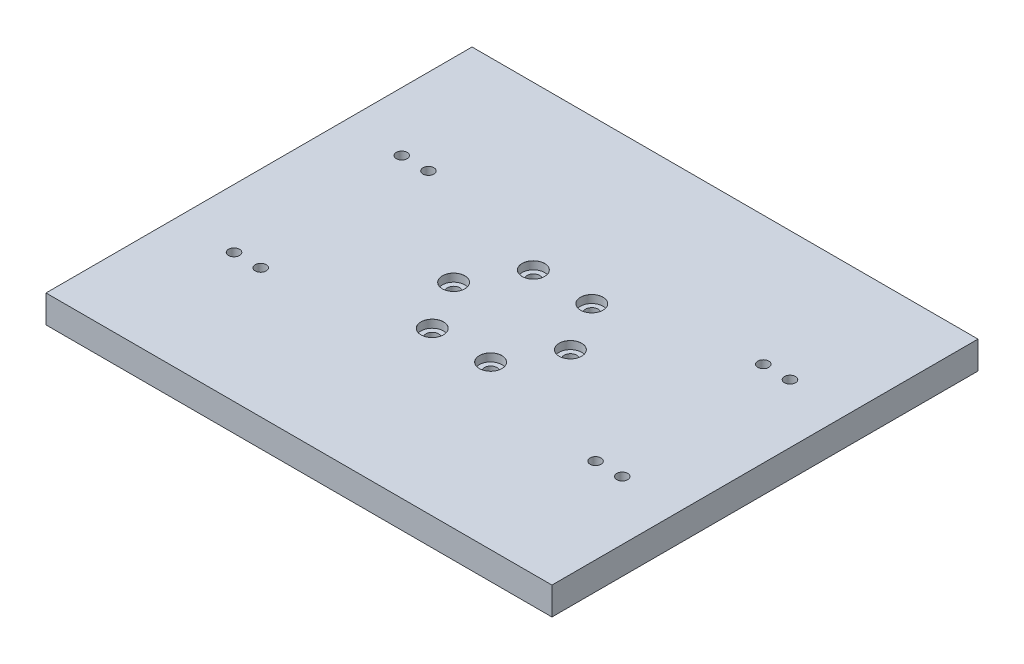
ISO-10303-21;
HEADER;
FILE_DESCRIPTION(('STEP AP214'),'2;1');
FILE_NAME('part.step','',(''),(''),'','','');
FILE_SCHEMA(('AUTOMOTIVE_DESIGN { 1 0 10303 214 1 1 1 1 }'));
ENDSEC;
DATA;
#1=APPLICATION_CONTEXT('core data for automotive mechanical design processes');
#2=APPLICATION_PROTOCOL_DEFINITION('international standard','automotive_design',2000,#1);
#3=PRODUCT_CONTEXT('',#1,'mechanical');
#4=PRODUCT('Part','Part','',(#3));
#5=PRODUCT_RELATED_PRODUCT_CATEGORY('part','',(#4));
#6=PRODUCT_DEFINITION_FORMATION('','',#4);
#7=PRODUCT_DEFINITION_CONTEXT('part definition',#1,'design');
#8=PRODUCT_DEFINITION('design','',#6,#7);
#9=PRODUCT_DEFINITION_SHAPE('','',#8);
#10=(LENGTH_UNIT() NAMED_UNIT(*) SI_UNIT(.MILLI.,.METRE.));
#11=(NAMED_UNIT(*) PLANE_ANGLE_UNIT() SI_UNIT($,.RADIAN.));
#12=(NAMED_UNIT(*) SI_UNIT($,.STERADIAN.) SOLID_ANGLE_UNIT());
#13=UNCERTAINTY_MEASURE_WITH_UNIT(LENGTH_MEASURE(1.E-05),#10,'distance_accuracy_value','');
#14=(GEOMETRIC_REPRESENTATION_CONTEXT(3) GLOBAL_UNCERTAINTY_ASSIGNED_CONTEXT((#13)) GLOBAL_UNIT_ASSIGNED_CONTEXT((#10,
#11,#12)) REPRESENTATION_CONTEXT('',''));
#15=CARTESIAN_POINT('',(0.,0.,0.));
#16=DIRECTION('',(0.,0.,1.));
#17=DIRECTION('',(1.,0.,0.));
#18=AXIS2_PLACEMENT_3D('',#15,#16,#17);
#19=CARTESIAN_POINT('',(241.3,26.416,203.2));
#20=DIRECTION('',(-1.,0.,0.));
#21=DIRECTION('',(0.,0.,1.));
#22=AXIS2_PLACEMENT_3D('',#19,#20,#21);
#23=PLANE('',#22);
#24=DIRECTION('',(0.,0.,-1.));
#25=VECTOR('',#24,1.);
#26=CARTESIAN_POINT('',(241.3,0.,203.2));
#27=LINE('',#26,#25);
#28=CARTESIAN_POINT('',(241.3,0.,203.2));
#29=VERTEX_POINT('',#28);
#30=CARTESIAN_POINT('',(241.3,0.,-203.2));
#31=VERTEX_POINT('',#30);
#32=EDGE_CURVE('E111',#29,#31,#27,.T.);
#33=ORIENTED_EDGE('',*,*,#32,.T.);
#34=DIRECTION('',(0.,-1.,0.));
#35=VECTOR('',#34,1.);
#36=CARTESIAN_POINT('',(241.3,26.416,-203.2));
#37=LINE('',#36,#35);
#38=CARTESIAN_POINT('',(241.3,26.416,-203.2));
#39=VERTEX_POINT('',#38);
#40=EDGE_CURVE('E11',#39,#31,#37,.T.);
#41=ORIENTED_EDGE('',*,*,#40,.F.);
#42=DIRECTION('',(0.,0.,-1.));
#43=VECTOR('',#42,1.);
#44=CARTESIAN_POINT('',(241.3,26.416,203.2));
#45=LINE('',#44,#43);
#46=CARTESIAN_POINT('',(241.3,26.416,203.2));
#47=VERTEX_POINT('',#46);
#48=EDGE_CURVE('E95',#47,#39,#45,.T.);
#49=ORIENTED_EDGE('',*,*,#48,.F.);
#50=DIRECTION('',(0.,-1.,0.));
#51=VECTOR('',#50,1.);
#52=CARTESIAN_POINT('',(241.3,26.416,203.2));
#53=LINE('',#52,#51);
#54=EDGE_CURVE('E107',#47,#29,#53,.T.);
#55=ORIENTED_EDGE('',*,*,#54,.T.);
#56=EDGE_LOOP('',(#33,#41,#49,#55));
#57=FACE_BOUND('',#56,.T.);
#58=ADVANCED_FACE('F43',(#57),#23,.F.);
#59=CARTESIAN_POINT('',(-241.3,26.416,-203.2));
#60=DIRECTION('',(0.,0.,1.));
#61=DIRECTION('',(1.,0.,0.));
#62=AXIS2_PLACEMENT_3D('',#59,#60,#61);
#63=PLANE('',#62);
#64=DIRECTION('',(-1.,0.,0.));
#65=VECTOR('',#64,1.);
#66=CARTESIAN_POINT('',(-241.3,0.,-203.2));
#67=LINE('',#66,#65);
#68=CARTESIAN_POINT('',(-241.3,0.,-203.2));
#69=VERTEX_POINT('',#68);
#70=EDGE_CURVE('E100',#31,#69,#67,.T.);
#71=ORIENTED_EDGE('',*,*,#70,.T.);
#72=DIRECTION('',(0.,-1.,0.));
#73=VECTOR('',#72,1.);
#74=CARTESIAN_POINT('',(-241.3,26.416,-203.2));
#75=LINE('',#74,#73);
#76=CARTESIAN_POINT('',(-241.3,26.416,-203.2));
#77=VERTEX_POINT('',#76);
#78=EDGE_CURVE('E52',#77,#69,#75,.T.);
#79=ORIENTED_EDGE('',*,*,#78,.F.);
#80=DIRECTION('',(-1.,0.,0.));
#81=VECTOR('',#80,1.);
#82=CARTESIAN_POINT('',(-241.3,26.416,-203.2));
#83=LINE('',#82,#81);
#84=EDGE_CURVE('E90',#39,#77,#83,.T.);
#85=ORIENTED_EDGE('',*,*,#84,.F.);
#86=ORIENTED_EDGE('',*,*,#40,.T.);
#87=EDGE_LOOP('',(#71,#79,#85,#86));
#88=FACE_BOUND('',#87,.T.);
#89=ADVANCED_FACE('F99',(#88),#63,.F.);
#90=CARTESIAN_POINT('',(-241.3,26.416,203.2));
#91=DIRECTION('',(1.,0.,0.));
#92=DIRECTION('',(0.,0.,-1.));
#93=AXIS2_PLACEMENT_3D('',#90,#91,#92);
#94=PLANE('',#93);
#95=DIRECTION('',(0.,0.,1.));
#96=VECTOR('',#95,1.);
#97=CARTESIAN_POINT('',(-241.3,0.,203.2));
#98=LINE('',#97,#96);
#99=CARTESIAN_POINT('',(-241.3,0.,203.2));
#100=VERTEX_POINT('',#99);
#101=EDGE_CURVE('E77',#69,#100,#98,.T.);
#102=ORIENTED_EDGE('',*,*,#101,.T.);
#103=DIRECTION('',(0.,-1.,0.));
#104=VECTOR('',#103,1.);
#105=CARTESIAN_POINT('',(-241.3,26.416,203.2));
#106=LINE('',#105,#104);
#107=CARTESIAN_POINT('',(-241.3,26.416,203.2));
#108=VERTEX_POINT('',#107);
#109=EDGE_CURVE('E102',#108,#100,#106,.T.);
#110=ORIENTED_EDGE('',*,*,#109,.F.);
#111=DIRECTION('',(0.,0.,1.));
#112=VECTOR('',#111,1.);
#113=CARTESIAN_POINT('',(-241.3,26.416,203.2));
#114=LINE('',#113,#112);
#115=EDGE_CURVE('E93',#77,#108,#114,.T.);
#116=ORIENTED_EDGE('',*,*,#115,.F.);
#117=ORIENTED_EDGE('',*,*,#78,.T.);
#118=EDGE_LOOP('',(#102,#110,#116,#117));
#119=FACE_BOUND('',#118,.T.);
#120=ADVANCED_FACE('F103',(#119),#94,.F.);
#121=CARTESIAN_POINT('',(-241.3,26.416,203.2));
#122=DIRECTION('',(0.,0.,-1.));
#123=DIRECTION('',(-1.,0.,0.));
#124=AXIS2_PLACEMENT_3D('',#121,#122,#123);
#125=PLANE('',#124);
#126=DIRECTION('',(1.,0.,0.));
#127=VECTOR('',#126,1.);
#128=CARTESIAN_POINT('',(-241.3,0.,203.2));
#129=LINE('',#128,#127);
#130=EDGE_CURVE('E83',#100,#29,#129,.T.);
#131=ORIENTED_EDGE('',*,*,#130,.T.);
#132=ORIENTED_EDGE('',*,*,#54,.F.);
#133=DIRECTION('',(1.,0.,0.));
#134=VECTOR('',#133,1.);
#135=CARTESIAN_POINT('',(-241.3,26.416,203.2));
#136=LINE('',#135,#134);
#137=EDGE_CURVE('E60',#108,#47,#136,.T.);
#138=ORIENTED_EDGE('',*,*,#137,.F.);
#139=ORIENTED_EDGE('',*,*,#109,.T.);
#140=EDGE_LOOP('',(#131,#132,#138,#139));
#141=FACE_BOUND('',#140,.T.);
#142=ADVANCED_FACE('F125',(#141),#125,.F.);
#143=CARTESIAN_POINT('',(0.,26.416,0.));
#144=DIRECTION('',(0.,-1.,0.));
#145=DIRECTION('',(0.,0.,-1.));
#146=AXIS2_PLACEMENT_3D('',#143,#144,#145);
#147=PLANE('',#146);
#148=CARTESIAN_POINT('',(-185.152559706437,26.416,80.01));
#149=DIRECTION('',(0.,1.,0.));
#150=DIRECTION('',(0.,0.,1.));
#151=AXIS2_PLACEMENT_3D('',#148,#149,#150);
#152=CIRCLE('',#151,5.25);
#153=CARTESIAN_POINT('',(-185.152559706437,26.416,85.26));
#154=VERTEX_POINT('',#153);
#155=EDGE_CURVE('E311',#154,#154,#152,.T.);
#156=ORIENTED_EDGE('',*,*,#155,.F.);
#157=EDGE_LOOP('',(#156));
#158=FACE_BOUND('',#157,.T.);
#159=CARTESIAN_POINT('',(-159.68726,26.416,80.01));
#160=DIRECTION('',(0.,1.,0.));
#161=DIRECTION('',(0.,0.,1.));
#162=AXIS2_PLACEMENT_3D('',#159,#160,#161);
#163=CIRCLE('',#162,5.25);
#164=CARTESIAN_POINT('',(-159.68726,26.416,85.26));
#165=VERTEX_POINT('',#164);
#166=EDGE_CURVE('E303',#165,#165,#163,.T.);
#167=ORIENTED_EDGE('',*,*,#166,.F.);
#168=EDGE_LOOP('',(#167));
#169=FACE_BOUND('',#168,.T.);
#170=CARTESIAN_POINT('',(-185.152559706437,26.416,-80.01));
#171=DIRECTION('',(0.,1.,0.));
#172=DIRECTION('',(0.,0.,1.));
#173=AXIS2_PLACEMENT_3D('',#170,#171,#172);
#174=CIRCLE('',#173,5.25);
#175=CARTESIAN_POINT('',(-185.152559706437,26.416,-74.76));
#176=VERTEX_POINT('',#175);
#177=EDGE_CURVE('E295',#176,#176,#174,.T.);
#178=ORIENTED_EDGE('',*,*,#177,.F.);
#179=EDGE_LOOP('',(#178));
#180=FACE_BOUND('',#179,.T.);
#181=CARTESIAN_POINT('',(-159.68726,26.416,-80.01));
#182=DIRECTION('',(0.,1.,0.));
#183=DIRECTION('',(0.,0.,1.));
#184=AXIS2_PLACEMENT_3D('',#181,#182,#183);
#185=CIRCLE('',#184,5.25);
#186=CARTESIAN_POINT('',(-159.68726,26.416,-74.76));
#187=VERTEX_POINT('',#186);
#188=EDGE_CURVE('E287',#187,#187,#185,.T.);
#189=ORIENTED_EDGE('',*,*,#188,.F.);
#190=EDGE_LOOP('',(#189));
#191=FACE_BOUND('',#190,.T.);
#192=CARTESIAN_POINT('',(185.152559706437,26.416,-80.01));
#193=DIRECTION('',(0.,1.,0.));
#194=DIRECTION('',(0.,0.,1.));
#195=AXIS2_PLACEMENT_3D('',#192,#193,#194);
#196=CIRCLE('',#195,5.25);
#197=CARTESIAN_POINT('',(185.152559706437,26.416,-74.76));
#198=VERTEX_POINT('',#197);
#199=EDGE_CURVE('E279',#198,#198,#196,.T.);
#200=ORIENTED_EDGE('',*,*,#199,.F.);
#201=EDGE_LOOP('',(#200));
#202=FACE_BOUND('',#201,.T.);
#203=CARTESIAN_POINT('',(159.68726,26.416,-80.01));
#204=DIRECTION('',(0.,1.,0.));
#205=DIRECTION('',(0.,0.,1.));
#206=AXIS2_PLACEMENT_3D('',#203,#204,#205);
#207=CIRCLE('',#206,5.25);
#208=CARTESIAN_POINT('',(159.68726,26.416,-74.76));
#209=VERTEX_POINT('',#208);
#210=EDGE_CURVE('E271',#209,#209,#207,.T.);
#211=ORIENTED_EDGE('',*,*,#210,.F.);
#212=EDGE_LOOP('',(#211));
#213=FACE_BOUND('',#212,.T.);
#214=CARTESIAN_POINT('',(185.152559706437,26.416,80.01));
#215=DIRECTION('',(0.,1.,0.));
#216=DIRECTION('',(0.,0.,1.));
#217=AXIS2_PLACEMENT_3D('',#214,#215,#216);
#218=CIRCLE('',#217,5.25);
#219=CARTESIAN_POINT('',(185.152559706437,26.416,85.26));
#220=VERTEX_POINT('',#219);
#221=EDGE_CURVE('E263',#220,#220,#218,.T.);
#222=ORIENTED_EDGE('',*,*,#221,.F.);
#223=EDGE_LOOP('',(#222));
#224=FACE_BOUND('',#223,.T.);
#225=CARTESIAN_POINT('',(159.68726,26.416,80.01));
#226=DIRECTION('',(0.,1.,0.));
#227=DIRECTION('',(0.,0.,1.));
#228=AXIS2_PLACEMENT_3D('',#225,#226,#227);
#229=CIRCLE('',#228,5.25);
#230=CARTESIAN_POINT('',(159.68726,26.416,85.26));
#231=VERTEX_POINT('',#230);
#232=EDGE_CURVE('E255',#231,#231,#229,.T.);
#233=ORIENTED_EDGE('',*,*,#232,.F.);
#234=EDGE_LOOP('',(#233));
#235=FACE_BOUND('',#234,.T.);
#236=CARTESIAN_POINT('',(27.8500000000006,26.416,-48.2376149907929));
#237=DIRECTION('',(0.,1.,0.));
#238=DIRECTION('',(0.,0.,1.));
#239=AXIS2_PLACEMENT_3D('',#236,#237,#238);
#240=CIRCLE('',#239,10.765);
#241=CARTESIAN_POINT('',(27.8500000000006,26.416,-37.4726149907929));
#242=VERTEX_POINT('',#241);
#243=EDGE_CURVE('E247',#242,#242,#240,.T.);
#244=ORIENTED_EDGE('',*,*,#243,.F.);
#245=EDGE_LOOP('',(#244));
#246=FACE_BOUND('',#245,.T.);
#247=CARTESIAN_POINT('',(55.7,26.416,0.));
#248=DIRECTION('',(0.,1.,0.));
#249=DIRECTION('',(0.,0.,1.));
#250=AXIS2_PLACEMENT_3D('',#247,#248,#249);
#251=CIRCLE('',#250,10.765);
#252=CARTESIAN_POINT('',(55.7,26.416,10.765));
#253=VERTEX_POINT('',#252);
#254=EDGE_CURVE('E227',#253,#253,#251,.T.);
#255=ORIENTED_EDGE('',*,*,#254,.F.);
#256=EDGE_LOOP('',(#255));
#257=FACE_BOUND('',#256,.T.);
#258=CARTESIAN_POINT('',(27.8499999999999,26.416,48.2376149907933));
#259=DIRECTION('',(0.,1.,0.));
#260=DIRECTION('',(0.,0.,1.));
#261=AXIS2_PLACEMENT_3D('',#258,#259,#260);
#262=CIRCLE('',#261,10.765);
#263=CARTESIAN_POINT('',(27.8499999999999,26.416,59.0026149907933));
#264=VERTEX_POINT('',#263);
#265=EDGE_CURVE('E207',#264,#264,#262,.T.);
#266=ORIENTED_EDGE('',*,*,#265,.F.);
#267=EDGE_LOOP('',(#266));
#268=FACE_BOUND('',#267,.T.);
#269=CARTESIAN_POINT('',(-27.8500000000002,26.416,48.2376149907931));
#270=DIRECTION('',(0.,1.,0.));
#271=DIRECTION('',(0.,0.,1.));
#272=AXIS2_PLACEMENT_3D('',#269,#270,#271);
#273=CIRCLE('',#272,10.765);
#274=CARTESIAN_POINT('',(-27.8500000000002,26.416,59.0026149907931));
#275=VERTEX_POINT('',#274);
#276=EDGE_CURVE('E187',#275,#275,#273,.T.);
#277=ORIENTED_EDGE('',*,*,#276,.F.);
#278=EDGE_LOOP('',(#277));
#279=FACE_BOUND('',#278,.T.);
#280=CARTESIAN_POINT('',(-55.7,26.416,-3.88951021147125E-13));
#281=DIRECTION('',(0.,1.,0.));
#282=DIRECTION('',(0.,0.,1.));
#283=AXIS2_PLACEMENT_3D('',#280,#281,#282);
#284=CIRCLE('',#283,10.765);
#285=CARTESIAN_POINT('',(-55.7,26.416,10.7649999999996));
#286=VERTEX_POINT('',#285);
#287=EDGE_CURVE('E167',#286,#286,#284,.T.);
#288=ORIENTED_EDGE('',*,*,#287,.F.);
#289=EDGE_LOOP('',(#288));
#290=FACE_BOUND('',#289,.T.);
#291=CARTESIAN_POINT('',(-27.8500000000002,26.416,-48.2376149907929));
#292=DIRECTION('',(0.,1.,0.));
#293=DIRECTION('',(0.,0.,1.));
#294=AXIS2_PLACEMENT_3D('',#291,#292,#293);
#295=CIRCLE('',#294,10.765);
#296=CARTESIAN_POINT('',(-27.8500000000002,26.416,-37.4726149907929));
#297=VERTEX_POINT('',#296);
#298=EDGE_CURVE('E147',#297,#297,#295,.T.);
#299=ORIENTED_EDGE('',*,*,#298,.F.);
#300=EDGE_LOOP('',(#299));
#301=FACE_BOUND('',#300,.T.);
#302=ORIENTED_EDGE('',*,*,#48,.T.);
#303=ORIENTED_EDGE('',*,*,#84,.T.);
#304=ORIENTED_EDGE('',*,*,#115,.T.);
#305=ORIENTED_EDGE('',*,*,#137,.T.);
#306=EDGE_LOOP('',(#302,#303,#304,#305));
#307=FACE_BOUND('',#306,.T.);
#308=ADVANCED_FACE('F91',(#158,#169,#180,#191,#202,#213,#224,#235,#246,#257,#268,#279,#290,#301,
#307),#147,.F.);
#309=CARTESIAN_POINT('',(0.,0.,0.));
#310=DIRECTION('',(0.,-1.,0.));
#311=DIRECTION('',(0.,0.,-1.));
#312=AXIS2_PLACEMENT_3D('',#309,#310,#311);
#313=PLANE('',#312);
#314=CARTESIAN_POINT('',(-185.152559706437,0.,80.01));
#315=DIRECTION('',(0.,1.,0.));
#316=DIRECTION('',(0.,0.,1.));
#317=AXIS2_PLACEMENT_3D('',#314,#315,#316);
#318=CIRCLE('',#317,5.25);
#319=CARTESIAN_POINT('',(-185.152559706437,0.,85.26));
#320=VERTEX_POINT('',#319);
#321=EDGE_CURVE('E307',#320,#320,#318,.T.);
#322=ORIENTED_EDGE('',*,*,#321,.T.);
#323=EDGE_LOOP('',(#322));
#324=FACE_BOUND('',#323,.T.);
#325=CARTESIAN_POINT('',(-159.68726,0.,80.01));
#326=DIRECTION('',(0.,1.,0.));
#327=DIRECTION('',(0.,0.,1.));
#328=AXIS2_PLACEMENT_3D('',#325,#326,#327);
#329=CIRCLE('',#328,5.25);
#330=CARTESIAN_POINT('',(-159.68726,0.,85.26));
#331=VERTEX_POINT('',#330);
#332=EDGE_CURVE('E299',#331,#331,#329,.T.);
#333=ORIENTED_EDGE('',*,*,#332,.T.);
#334=EDGE_LOOP('',(#333));
#335=FACE_BOUND('',#334,.T.);
#336=CARTESIAN_POINT('',(-185.152559706437,0.,-80.01));
#337=DIRECTION('',(0.,1.,0.));
#338=DIRECTION('',(0.,0.,1.));
#339=AXIS2_PLACEMENT_3D('',#336,#337,#338);
#340=CIRCLE('',#339,5.25);
#341=CARTESIAN_POINT('',(-185.152559706437,0.,-74.76));
#342=VERTEX_POINT('',#341);
#343=EDGE_CURVE('E291',#342,#342,#340,.T.);
#344=ORIENTED_EDGE('',*,*,#343,.T.);
#345=EDGE_LOOP('',(#344));
#346=FACE_BOUND('',#345,.T.);
#347=CARTESIAN_POINT('',(-159.68726,0.,-80.01));
#348=DIRECTION('',(0.,1.,0.));
#349=DIRECTION('',(0.,0.,1.));
#350=AXIS2_PLACEMENT_3D('',#347,#348,#349);
#351=CIRCLE('',#350,5.25);
#352=CARTESIAN_POINT('',(-159.68726,0.,-74.76));
#353=VERTEX_POINT('',#352);
#354=EDGE_CURVE('E283',#353,#353,#351,.T.);
#355=ORIENTED_EDGE('',*,*,#354,.T.);
#356=EDGE_LOOP('',(#355));
#357=FACE_BOUND('',#356,.T.);
#358=CARTESIAN_POINT('',(185.152559706437,0.,-80.01));
#359=DIRECTION('',(0.,1.,0.));
#360=DIRECTION('',(0.,0.,1.));
#361=AXIS2_PLACEMENT_3D('',#358,#359,#360);
#362=CIRCLE('',#361,5.25);
#363=CARTESIAN_POINT('',(185.152559706437,0.,-74.76));
#364=VERTEX_POINT('',#363);
#365=EDGE_CURVE('E275',#364,#364,#362,.T.);
#366=ORIENTED_EDGE('',*,*,#365,.T.);
#367=EDGE_LOOP('',(#366));
#368=FACE_BOUND('',#367,.T.);
#369=CARTESIAN_POINT('',(159.68726,0.,-80.01));
#370=DIRECTION('',(0.,1.,0.));
#371=DIRECTION('',(0.,0.,1.));
#372=AXIS2_PLACEMENT_3D('',#369,#370,#371);
#373=CIRCLE('',#372,5.25);
#374=CARTESIAN_POINT('',(159.68726,0.,-74.76));
#375=VERTEX_POINT('',#374);
#376=EDGE_CURVE('E267',#375,#375,#373,.T.);
#377=ORIENTED_EDGE('',*,*,#376,.T.);
#378=EDGE_LOOP('',(#377));
#379=FACE_BOUND('',#378,.T.);
#380=CARTESIAN_POINT('',(185.152559706437,0.,80.01));
#381=DIRECTION('',(0.,1.,0.));
#382=DIRECTION('',(0.,0.,1.));
#383=AXIS2_PLACEMENT_3D('',#380,#381,#382);
#384=CIRCLE('',#383,5.25);
#385=CARTESIAN_POINT('',(185.152559706437,0.,85.26));
#386=VERTEX_POINT('',#385);
#387=EDGE_CURVE('E259',#386,#386,#384,.T.);
#388=ORIENTED_EDGE('',*,*,#387,.T.);
#389=EDGE_LOOP('',(#388));
#390=FACE_BOUND('',#389,.T.);
#391=CARTESIAN_POINT('',(159.68726,0.,80.01));
#392=DIRECTION('',(0.,1.,0.));
#393=DIRECTION('',(0.,0.,1.));
#394=AXIS2_PLACEMENT_3D('',#391,#392,#393);
#395=CIRCLE('',#394,5.25);
#396=CARTESIAN_POINT('',(159.68726,0.,85.26));
#397=VERTEX_POINT('',#396);
#398=EDGE_CURVE('E251',#397,#397,#395,.T.);
#399=ORIENTED_EDGE('',*,*,#398,.T.);
#400=EDGE_LOOP('',(#399));
#401=FACE_BOUND('',#400,.T.);
#402=CARTESIAN_POINT('',(27.8500000000006,0.,-48.2376149907929));
#403=DIRECTION('',(0.,1.,0.));
#404=DIRECTION('',(0.,0.,1.));
#405=AXIS2_PLACEMENT_3D('',#402,#403,#404);
#406=CIRCLE('',#405,5.99999999999999);
#407=CARTESIAN_POINT('',(27.8500000000006,0.,-42.2376149907929));
#408=VERTEX_POINT('',#407);
#409=EDGE_CURVE('E231',#408,#408,#406,.T.);
#410=ORIENTED_EDGE('',*,*,#409,.T.);
#411=EDGE_LOOP('',(#410));
#412=FACE_BOUND('',#411,.T.);
#413=CARTESIAN_POINT('',(55.7,0.,0.));
#414=DIRECTION('',(0.,1.,0.));
#415=DIRECTION('',(0.,0.,1.));
#416=AXIS2_PLACEMENT_3D('',#413,#414,#415);
#417=CIRCLE('',#416,5.99999999999999);
#418=CARTESIAN_POINT('',(55.7,0.,5.99999999999999));
#419=VERTEX_POINT('',#418);
#420=EDGE_CURVE('E211',#419,#419,#417,.T.);
#421=ORIENTED_EDGE('',*,*,#420,.T.);
#422=EDGE_LOOP('',(#421));
#423=FACE_BOUND('',#422,.T.);
#424=CARTESIAN_POINT('',(27.8499999999999,0.,48.2376149907933));
#425=DIRECTION('',(0.,1.,0.));
#426=DIRECTION('',(0.,0.,1.));
#427=AXIS2_PLACEMENT_3D('',#424,#425,#426);
#428=CIRCLE('',#427,5.99999999999999);
#429=CARTESIAN_POINT('',(27.8499999999999,0.,54.2376149907933));
#430=VERTEX_POINT('',#429);
#431=EDGE_CURVE('E191',#430,#430,#428,.T.);
#432=ORIENTED_EDGE('',*,*,#431,.T.);
#433=EDGE_LOOP('',(#432));
#434=FACE_BOUND('',#433,.T.);
#435=CARTESIAN_POINT('',(-27.8500000000002,0.,48.2376149907931));
#436=DIRECTION('',(0.,1.,0.));
#437=DIRECTION('',(0.,0.,1.));
#438=AXIS2_PLACEMENT_3D('',#435,#436,#437);
#439=CIRCLE('',#438,5.99999999999999);
#440=CARTESIAN_POINT('',(-27.8500000000002,0.,54.2376149907931));
#441=VERTEX_POINT('',#440);
#442=EDGE_CURVE('E171',#441,#441,#439,.T.);
#443=ORIENTED_EDGE('',*,*,#442,.T.);
#444=EDGE_LOOP('',(#443));
#445=FACE_BOUND('',#444,.T.);
#446=CARTESIAN_POINT('',(-55.7,0.,-3.88951021147125E-13));
#447=DIRECTION('',(0.,1.,0.));
#448=DIRECTION('',(0.,0.,1.));
#449=AXIS2_PLACEMENT_3D('',#446,#447,#448);
#450=CIRCLE('',#449,5.99999999999999);
#451=CARTESIAN_POINT('',(-55.7,0.,5.9999999999996));
#452=VERTEX_POINT('',#451);
#453=EDGE_CURVE('E151',#452,#452,#450,.T.);
#454=ORIENTED_EDGE('',*,*,#453,.T.);
#455=EDGE_LOOP('',(#454));
#456=FACE_BOUND('',#455,.T.);
#457=CARTESIAN_POINT('',(-27.8500000000002,0.,-48.2376149907929));
#458=DIRECTION('',(0.,1.,0.));
#459=DIRECTION('',(0.,0.,1.));
#460=AXIS2_PLACEMENT_3D('',#457,#458,#459);
#461=CIRCLE('',#460,5.99999999999999);
#462=CARTESIAN_POINT('',(-27.8500000000002,0.,-42.2376149907929));
#463=VERTEX_POINT('',#462);
#464=EDGE_CURVE('E115',#463,#463,#461,.T.);
#465=ORIENTED_EDGE('',*,*,#464,.T.);
#466=EDGE_LOOP('',(#465));
#467=FACE_BOUND('',#466,.T.);
#468=ORIENTED_EDGE('',*,*,#32,.F.);
#469=ORIENTED_EDGE('',*,*,#130,.F.);
#470=ORIENTED_EDGE('',*,*,#101,.F.);
#471=ORIENTED_EDGE('',*,*,#70,.F.);
#472=EDGE_LOOP('',(#468,#469,#470,#471));
#473=FACE_BOUND('',#472,.T.);
#474=ADVANCED_FACE('F128',(#324,#335,#346,#357,#368,#379,#390,#401,#412,#423,#434,#445,#456,
#467,#473),#313,.T.);
#475=CARTESIAN_POINT('',(-27.8500000000002,26.416,-48.2376149907929));
#476=DIRECTION('',(0.,1.,0.));
#477=DIRECTION('',(0.,0.,1.));
#478=AXIS2_PLACEMENT_3D('',#475,#476,#477);
#479=CYLINDRICAL_SURFACE('',#478,6.);
#480=ORIENTED_EDGE('',*,*,#464,.F.);
#481=EDGE_LOOP('',(#480));
#482=FACE_BOUND('',#481,.T.);
#483=CARTESIAN_POINT('',(-27.8500000000002,18.916,-48.2376149907929));
#484=DIRECTION('',(0.,1.,0.));
#485=DIRECTION('',(0.,0.,1.));
#486=AXIS2_PLACEMENT_3D('',#483,#484,#485);
#487=CIRCLE('',#486,6.);
#488=CARTESIAN_POINT('',(-27.8500000000002,18.916,-42.2376149907929));
#489=VERTEX_POINT('',#488);
#490=EDGE_CURVE('E135',#489,#489,#487,.T.);
#491=ORIENTED_EDGE('',*,*,#490,.T.);
#492=EDGE_LOOP('',(#491));
#493=FACE_BOUND('',#492,.T.);
#494=ADVANCED_FACE('F376',(#482,#493),#479,.F.);
#495=CARTESIAN_POINT('',(-17.1100000000002,18.916,-48.2376149907929));
#496=DIRECTION('',(0.,-1.,0.));
#497=DIRECTION('',(0.,0.,-1.));
#498=AXIS2_PLACEMENT_3D('',#495,#496,#497);
#499=PLANE('',#498);
#500=ORIENTED_EDGE('',*,*,#490,.F.);
#501=EDGE_LOOP('',(#500));
#502=FACE_BOUND('',#501,.T.);
#503=CARTESIAN_POINT('',(-27.8500000000002,18.916,-48.2376149907929));
#504=DIRECTION('',(0.,1.,0.));
#505=DIRECTION('',(0.,0.,1.));
#506=AXIS2_PLACEMENT_3D('',#503,#504,#505);
#507=CIRCLE('',#506,10.74);
#508=CARTESIAN_POINT('',(-27.8500000000002,18.916,-37.4976149907929));
#509=VERTEX_POINT('',#508);
#510=EDGE_CURVE('E139',#509,#509,#507,.T.);
#511=ORIENTED_EDGE('',*,*,#510,.T.);
#512=EDGE_LOOP('',(#511));
#513=FACE_BOUND('',#512,.T.);
#514=ADVANCED_FACE('F360',(#502,#513),#499,.F.);
#515=CARTESIAN_POINT('',(-27.8500000000002,26.416,-48.2376149907929));
#516=DIRECTION('',(0.,1.,0.));
#517=DIRECTION('',(0.,0.,1.));
#518=AXIS2_PLACEMENT_3D('',#515,#516,#517);
#519=CYLINDRICAL_SURFACE('',#518,10.74);
#520=ORIENTED_EDGE('',*,*,#510,.F.);
#521=EDGE_LOOP('',(#520));
#522=FACE_BOUND('',#521,.T.);
#523=CARTESIAN_POINT('',(-27.8500000000002,26.391,-48.2376149907929));
#524=DIRECTION('',(0.,1.,0.));
#525=DIRECTION('',(0.,0.,1.));
#526=AXIS2_PLACEMENT_3D('',#523,#524,#525);
#527=CIRCLE('',#526,10.74);
#528=CARTESIAN_POINT('',(-27.8500000000002,26.391,-37.4976149907929));
#529=VERTEX_POINT('',#528);
#530=EDGE_CURVE('E143',#529,#529,#527,.T.);
#531=ORIENTED_EDGE('',*,*,#530,.T.);
#532=EDGE_LOOP('',(#531));
#533=FACE_BOUND('',#532,.T.);
#534=ADVANCED_FACE('F350',(#522,#533),#519,.F.);
#535=CARTESIAN_POINT('',(-27.8500000000002,26.416,-48.2376149907929));
#536=DIRECTION('',(0.,1.,0.));
#537=DIRECTION('',(0.,0.,1.));
#538=AXIS2_PLACEMENT_3D('',#535,#536,#537);
#539=CONICAL_SURFACE('',#538,10.765,0.785398163397379);
#540=ORIENTED_EDGE('',*,*,#530,.F.);
#541=EDGE_LOOP('',(#540));
#542=FACE_BOUND('',#541,.T.);
#543=ORIENTED_EDGE('',*,*,#298,.T.);
#544=EDGE_LOOP('',(#543));
#545=FACE_BOUND('',#544,.T.);
#546=ADVANCED_FACE('F347',(#542,#545),#539,.F.);
#547=CARTESIAN_POINT('',(-55.7,26.416,-3.88951021147125E-13));
#548=DIRECTION('',(0.,1.,0.));
#549=DIRECTION('',(0.,0.,1.));
#550=AXIS2_PLACEMENT_3D('',#547,#548,#549);
#551=CYLINDRICAL_SURFACE('',#550,5.99999999999999);
#552=ORIENTED_EDGE('',*,*,#453,.F.);
#553=EDGE_LOOP('',(#552));
#554=FACE_BOUND('',#553,.T.);
#555=CARTESIAN_POINT('',(-55.7,18.916,-3.88951021147125E-13));
#556=DIRECTION('',(0.,1.,0.));
#557=DIRECTION('',(0.,0.,1.));
#558=AXIS2_PLACEMENT_3D('',#555,#556,#557);
#559=CIRCLE('',#558,6.);
#560=CARTESIAN_POINT('',(-55.7,18.916,5.99999999999961));
#561=VERTEX_POINT('',#560);
#562=EDGE_CURVE('E155',#561,#561,#559,.T.);
#563=ORIENTED_EDGE('',*,*,#562,.T.);
#564=EDGE_LOOP('',(#563));
#565=FACE_BOUND('',#564,.T.);
#566=ADVANCED_FACE('F349',(#554,#565),#551,.F.);
#567=CARTESIAN_POINT('',(-44.96,18.916,-3.88951021147125E-13));
#568=DIRECTION('',(0.,-1.,0.));
#569=DIRECTION('',(0.,0.,-1.));
#570=AXIS2_PLACEMENT_3D('',#567,#568,#569);
#571=PLANE('',#570);
#572=ORIENTED_EDGE('',*,*,#562,.F.);
#573=EDGE_LOOP('',(#572));
#574=FACE_BOUND('',#573,.T.);
#575=CARTESIAN_POINT('',(-55.7,18.916,-3.88951021147125E-13));
#576=DIRECTION('',(0.,1.,0.));
#577=DIRECTION('',(0.,0.,1.));
#578=AXIS2_PLACEMENT_3D('',#575,#576,#577);
#579=CIRCLE('',#578,10.74);
#580=CARTESIAN_POINT('',(-55.7,18.916,10.7399999999996));
#581=VERTEX_POINT('',#580);
#582=EDGE_CURVE('E159',#581,#581,#579,.T.);
#583=ORIENTED_EDGE('',*,*,#582,.T.);
#584=EDGE_LOOP('',(#583));
#585=FACE_BOUND('',#584,.T.);
#586=ADVANCED_FACE('F357',(#574,#585),#571,.F.);
#587=CARTESIAN_POINT('',(-55.7,26.416,-3.88951021147125E-13));
#588=DIRECTION('',(0.,1.,0.));
#589=DIRECTION('',(0.,0.,1.));
#590=AXIS2_PLACEMENT_3D('',#587,#588,#589);
#591=CYLINDRICAL_SURFACE('',#590,10.74);
#592=ORIENTED_EDGE('',*,*,#582,.F.);
#593=EDGE_LOOP('',(#592));
#594=FACE_BOUND('',#593,.T.);
#595=CARTESIAN_POINT('',(-55.7,26.391,-3.88951021147125E-13));
#596=DIRECTION('',(0.,1.,0.));
#597=DIRECTION('',(0.,0.,1.));
#598=AXIS2_PLACEMENT_3D('',#595,#596,#597);
#599=CIRCLE('',#598,10.74);
#600=CARTESIAN_POINT('',(-55.7,26.391,10.7399999999996));
#601=VERTEX_POINT('',#600);
#602=EDGE_CURVE('E163',#601,#601,#599,.T.);
#603=ORIENTED_EDGE('',*,*,#602,.T.);
#604=EDGE_LOOP('',(#603));
#605=FACE_BOUND('',#604,.T.);
#606=ADVANCED_FACE('F419',(#594,#605),#591,.F.);
#607=CARTESIAN_POINT('',(-55.7,26.416,-3.88951021147125E-13));
#608=DIRECTION('',(0.,1.,0.));
#609=DIRECTION('',(0.,0.,1.));
#610=AXIS2_PLACEMENT_3D('',#607,#608,#609);
#611=CONICAL_SURFACE('',#610,10.765,0.78539816339731);
#612=ORIENTED_EDGE('',*,*,#602,.F.);
#613=EDGE_LOOP('',(#612));
#614=FACE_BOUND('',#613,.T.);
#615=ORIENTED_EDGE('',*,*,#287,.T.);
#616=EDGE_LOOP('',(#615));
#617=FACE_BOUND('',#616,.T.);
#618=ADVANCED_FACE('F430',(#614,#617),#611,.F.);
#619=CARTESIAN_POINT('',(-27.8500000000002,26.416,48.2376149907931));
#620=DIRECTION('',(0.,1.,0.));
#621=DIRECTION('',(0.,0.,1.));
#622=AXIS2_PLACEMENT_3D('',#619,#620,#621);
#623=CYLINDRICAL_SURFACE('',#622,6.);
#624=ORIENTED_EDGE('',*,*,#442,.F.);
#625=EDGE_LOOP('',(#624));
#626=FACE_BOUND('',#625,.T.);
#627=CARTESIAN_POINT('',(-27.8500000000002,18.916,48.2376149907931));
#628=DIRECTION('',(0.,1.,0.));
#629=DIRECTION('',(0.,0.,1.));
#630=AXIS2_PLACEMENT_3D('',#627,#628,#629);
#631=CIRCLE('',#630,6.);
#632=CARTESIAN_POINT('',(-27.8500000000002,18.916,54.2376149907931));
#633=VERTEX_POINT('',#632);
#634=EDGE_CURVE('E175',#633,#633,#631,.T.);
#635=ORIENTED_EDGE('',*,*,#634,.T.);
#636=EDGE_LOOP('',(#635));
#637=FACE_BOUND('',#636,.T.);
#638=ADVANCED_FACE('F441',(#626,#637),#623,.F.);
#639=CARTESIAN_POINT('',(-17.1100000000002,18.916,48.2376149907931));
#640=DIRECTION('',(0.,-1.,0.));
#641=DIRECTION('',(0.,0.,-1.));
#642=AXIS2_PLACEMENT_3D('',#639,#640,#641);
#643=PLANE('',#642);
#644=ORIENTED_EDGE('',*,*,#634,.F.);
#645=EDGE_LOOP('',(#644));
#646=FACE_BOUND('',#645,.T.);
#647=CARTESIAN_POINT('',(-27.8500000000002,18.916,48.2376149907931));
#648=DIRECTION('',(0.,1.,0.));
#649=DIRECTION('',(0.,0.,1.));
#650=AXIS2_PLACEMENT_3D('',#647,#648,#649);
#651=CIRCLE('',#650,10.74);
#652=CARTESIAN_POINT('',(-27.8500000000002,18.916,58.9776149907931));
#653=VERTEX_POINT('',#652);
#654=EDGE_CURVE('E179',#653,#653,#651,.T.);
#655=ORIENTED_EDGE('',*,*,#654,.T.);
#656=EDGE_LOOP('',(#655));
#657=FACE_BOUND('',#656,.T.);
#658=ADVANCED_FACE('F452',(#646,#657),#643,.F.);
#659=CARTESIAN_POINT('',(-27.8500000000002,26.416,48.2376149907931));
#660=DIRECTION('',(0.,1.,0.));
#661=DIRECTION('',(0.,0.,1.));
#662=AXIS2_PLACEMENT_3D('',#659,#660,#661);
#663=CYLINDRICAL_SURFACE('',#662,10.74);
#664=ORIENTED_EDGE('',*,*,#654,.F.);
#665=EDGE_LOOP('',(#664));
#666=FACE_BOUND('',#665,.T.);
#667=CARTESIAN_POINT('',(-27.8500000000002,26.391,48.2376149907931));
#668=DIRECTION('',(0.,1.,0.));
#669=DIRECTION('',(0.,0.,1.));
#670=AXIS2_PLACEMENT_3D('',#667,#668,#669);
#671=CIRCLE('',#670,10.74);
#672=CARTESIAN_POINT('',(-27.8500000000002,26.391,58.9776149907931));
#673=VERTEX_POINT('',#672);
#674=EDGE_CURVE('E183',#673,#673,#671,.T.);
#675=ORIENTED_EDGE('',*,*,#674,.T.);
#676=EDGE_LOOP('',(#675));
#677=FACE_BOUND('',#676,.T.);
#678=ADVANCED_FACE('F463',(#666,#677),#663,.F.);
#679=CARTESIAN_POINT('',(-27.8500000000002,26.416,48.2376149907931));
#680=DIRECTION('',(0.,1.,0.));
#681=DIRECTION('',(0.,0.,1.));
#682=AXIS2_PLACEMENT_3D('',#679,#680,#681);
#683=CONICAL_SURFACE('',#682,10.765,0.785398163397379);
#684=ORIENTED_EDGE('',*,*,#674,.F.);
#685=EDGE_LOOP('',(#684));
#686=FACE_BOUND('',#685,.T.);
#687=ORIENTED_EDGE('',*,*,#276,.T.);
#688=EDGE_LOOP('',(#687));
#689=FACE_BOUND('',#688,.T.);
#690=ADVANCED_FACE('F474',(#686,#689),#683,.F.);
#691=CARTESIAN_POINT('',(27.8499999999999,26.416,48.2376149907933));
#692=DIRECTION('',(0.,1.,0.));
#693=DIRECTION('',(0.,0.,1.));
#694=AXIS2_PLACEMENT_3D('',#691,#692,#693);
#695=CYLINDRICAL_SURFACE('',#694,5.99999999999999);
#696=ORIENTED_EDGE('',*,*,#431,.F.);
#697=EDGE_LOOP('',(#696));
#698=FACE_BOUND('',#697,.T.);
#699=CARTESIAN_POINT('',(27.8499999999999,18.916,48.2376149907933));
#700=DIRECTION('',(0.,1.,0.));
#701=DIRECTION('',(0.,0.,1.));
#702=AXIS2_PLACEMENT_3D('',#699,#700,#701);
#703=CIRCLE('',#702,6.);
#704=CARTESIAN_POINT('',(27.8499999999999,18.916,54.2376149907933));
#705=VERTEX_POINT('',#704);
#706=EDGE_CURVE('E195',#705,#705,#703,.T.);
#707=ORIENTED_EDGE('',*,*,#706,.T.);
#708=EDGE_LOOP('',(#707));
#709=FACE_BOUND('',#708,.T.);
#710=ADVANCED_FACE('F485',(#698,#709),#695,.F.);
#711=CARTESIAN_POINT('',(38.5899999999999,18.916,48.2376149907933));
#712=DIRECTION('',(0.,-1.,0.));
#713=DIRECTION('',(0.,0.,-1.));
#714=AXIS2_PLACEMENT_3D('',#711,#712,#713);
#715=PLANE('',#714);
#716=ORIENTED_EDGE('',*,*,#706,.F.);
#717=EDGE_LOOP('',(#716));
#718=FACE_BOUND('',#717,.T.);
#719=CARTESIAN_POINT('',(27.8499999999999,18.916,48.2376149907933));
#720=DIRECTION('',(0.,1.,0.));
#721=DIRECTION('',(0.,0.,1.));
#722=AXIS2_PLACEMENT_3D('',#719,#720,#721);
#723=CIRCLE('',#722,10.74);
#724=CARTESIAN_POINT('',(27.8499999999999,18.916,58.9776149907933));
#725=VERTEX_POINT('',#724);
#726=EDGE_CURVE('E199',#725,#725,#723,.T.);
#727=ORIENTED_EDGE('',*,*,#726,.T.);
#728=EDGE_LOOP('',(#727));
#729=FACE_BOUND('',#728,.T.);
#730=ADVANCED_FACE('F496',(#718,#729),#715,.F.);
#731=CARTESIAN_POINT('',(27.8499999999999,26.416,48.2376149907933));
#732=DIRECTION('',(0.,1.,0.));
#733=DIRECTION('',(0.,0.,1.));
#734=AXIS2_PLACEMENT_3D('',#731,#732,#733);
#735=CYLINDRICAL_SURFACE('',#734,10.74);
#736=ORIENTED_EDGE('',*,*,#726,.F.);
#737=EDGE_LOOP('',(#736));
#738=FACE_BOUND('',#737,.T.);
#739=CARTESIAN_POINT('',(27.8499999999999,26.391,48.2376149907933));
#740=DIRECTION('',(0.,1.,0.));
#741=DIRECTION('',(0.,0.,1.));
#742=AXIS2_PLACEMENT_3D('',#739,#740,#741);
#743=CIRCLE('',#742,10.74);
#744=CARTESIAN_POINT('',(27.8499999999999,26.391,58.9776149907933));
#745=VERTEX_POINT('',#744);
#746=EDGE_CURVE('E203',#745,#745,#743,.T.);
#747=ORIENTED_EDGE('',*,*,#746,.T.);
#748=EDGE_LOOP('',(#747));
#749=FACE_BOUND('',#748,.T.);
#750=ADVANCED_FACE('F507',(#738,#749),#735,.F.);
#751=CARTESIAN_POINT('',(27.8499999999999,26.416,48.2376149907933));
#752=DIRECTION('',(0.,1.,0.));
#753=DIRECTION('',(0.,0.,1.));
#754=AXIS2_PLACEMENT_3D('',#751,#752,#753);
#755=CONICAL_SURFACE('',#754,10.765,0.78539816339731);
#756=ORIENTED_EDGE('',*,*,#746,.F.);
#757=EDGE_LOOP('',(#756));
#758=FACE_BOUND('',#757,.T.);
#759=ORIENTED_EDGE('',*,*,#265,.T.);
#760=EDGE_LOOP('',(#759));
#761=FACE_BOUND('',#760,.T.);
#762=ADVANCED_FACE('F518',(#758,#761),#755,.F.);
#763=CARTESIAN_POINT('',(55.7,26.416,0.));
#764=DIRECTION('',(0.,1.,0.));
#765=DIRECTION('',(0.,0.,1.));
#766=AXIS2_PLACEMENT_3D('',#763,#764,#765);
#767=CYLINDRICAL_SURFACE('',#766,5.99999999999999);
#768=ORIENTED_EDGE('',*,*,#420,.F.);
#769=EDGE_LOOP('',(#768));
#770=FACE_BOUND('',#769,.T.);
#771=CARTESIAN_POINT('',(55.7,18.916,0.));
#772=DIRECTION('',(0.,1.,0.));
#773=DIRECTION('',(0.,0.,1.));
#774=AXIS2_PLACEMENT_3D('',#771,#772,#773);
#775=CIRCLE('',#774,6.);
#776=CARTESIAN_POINT('',(55.7,18.916,6.));
#777=VERTEX_POINT('',#776);
#778=EDGE_CURVE('E215',#777,#777,#775,.T.);
#779=ORIENTED_EDGE('',*,*,#778,.T.);
#780=EDGE_LOOP('',(#779));
#781=FACE_BOUND('',#780,.T.);
#782=ADVANCED_FACE('F529',(#770,#781),#767,.F.);
#783=CARTESIAN_POINT('',(66.44,18.916,0.));
#784=DIRECTION('',(0.,-1.,0.));
#785=DIRECTION('',(0.,0.,-1.));
#786=AXIS2_PLACEMENT_3D('',#783,#784,#785);
#787=PLANE('',#786);
#788=ORIENTED_EDGE('',*,*,#778,.F.);
#789=EDGE_LOOP('',(#788));
#790=FACE_BOUND('',#789,.T.);
#791=CARTESIAN_POINT('',(55.7,18.916,0.));
#792=DIRECTION('',(0.,1.,0.));
#793=DIRECTION('',(0.,0.,1.));
#794=AXIS2_PLACEMENT_3D('',#791,#792,#793);
#795=CIRCLE('',#794,10.74);
#796=CARTESIAN_POINT('',(55.7,18.916,10.74));
#797=VERTEX_POINT('',#796);
#798=EDGE_CURVE('E219',#797,#797,#795,.T.);
#799=ORIENTED_EDGE('',*,*,#798,.T.);
#800=EDGE_LOOP('',(#799));
#801=FACE_BOUND('',#800,.T.);
#802=ADVANCED_FACE('F540',(#790,#801),#787,.F.);
#803=CARTESIAN_POINT('',(55.7,26.416,0.));
#804=DIRECTION('',(0.,1.,0.));
#805=DIRECTION('',(0.,0.,1.));
#806=AXIS2_PLACEMENT_3D('',#803,#804,#805);
#807=CYLINDRICAL_SURFACE('',#806,10.74);
#808=ORIENTED_EDGE('',*,*,#798,.F.);
#809=EDGE_LOOP('',(#808));
#810=FACE_BOUND('',#809,.T.);
#811=CARTESIAN_POINT('',(55.7,26.391,0.));
#812=DIRECTION('',(0.,1.,0.));
#813=DIRECTION('',(0.,0.,1.));
#814=AXIS2_PLACEMENT_3D('',#811,#812,#813);
#815=CIRCLE('',#814,10.74);
#816=CARTESIAN_POINT('',(55.7,26.391,10.74));
#817=VERTEX_POINT('',#816);
#818=EDGE_CURVE('E223',#817,#817,#815,.T.);
#819=ORIENTED_EDGE('',*,*,#818,.T.);
#820=EDGE_LOOP('',(#819));
#821=FACE_BOUND('',#820,.T.);
#822=ADVANCED_FACE('F551',(#810,#821),#807,.F.);
#823=CARTESIAN_POINT('',(55.7,26.416,0.));
#824=DIRECTION('',(0.,1.,0.));
#825=DIRECTION('',(0.,0.,1.));
#826=AXIS2_PLACEMENT_3D('',#823,#824,#825);
#827=CONICAL_SURFACE('',#826,10.765,0.785398163397448);
#828=ORIENTED_EDGE('',*,*,#818,.F.);
#829=EDGE_LOOP('',(#828));
#830=FACE_BOUND('',#829,.T.);
#831=ORIENTED_EDGE('',*,*,#254,.T.);
#832=EDGE_LOOP('',(#831));
#833=FACE_BOUND('',#832,.T.);
#834=ADVANCED_FACE('F562',(#830,#833),#827,.F.);
#835=CARTESIAN_POINT('',(27.8500000000006,26.416,-48.2376149907929));
#836=DIRECTION('',(0.,1.,0.));
#837=DIRECTION('',(0.,0.,1.));
#838=AXIS2_PLACEMENT_3D('',#835,#836,#837);
#839=CYLINDRICAL_SURFACE('',#838,5.99999999999999);
#840=ORIENTED_EDGE('',*,*,#409,.F.);
#841=EDGE_LOOP('',(#840));
#842=FACE_BOUND('',#841,.T.);
#843=CARTESIAN_POINT('',(27.8500000000006,18.916,-48.2376149907929));
#844=DIRECTION('',(0.,1.,0.));
#845=DIRECTION('',(0.,0.,1.));
#846=AXIS2_PLACEMENT_3D('',#843,#844,#845);
#847=CIRCLE('',#846,6.);
#848=CARTESIAN_POINT('',(27.8500000000006,18.916,-42.2376149907929));
#849=VERTEX_POINT('',#848);
#850=EDGE_CURVE('E235',#849,#849,#847,.T.);
#851=ORIENTED_EDGE('',*,*,#850,.T.);
#852=EDGE_LOOP('',(#851));
#853=FACE_BOUND('',#852,.T.);
#854=ADVANCED_FACE('F573',(#842,#853),#839,.F.);
#855=CARTESIAN_POINT('',(38.5900000000006,18.916,-48.2376149907929));
#856=DIRECTION('',(0.,-1.,0.));
#857=DIRECTION('',(0.,0.,-1.));
#858=AXIS2_PLACEMENT_3D('',#855,#856,#857);
#859=PLANE('',#858);
#860=ORIENTED_EDGE('',*,*,#850,.F.);
#861=EDGE_LOOP('',(#860));
#862=FACE_BOUND('',#861,.T.);
#863=CARTESIAN_POINT('',(27.8500000000006,18.916,-48.2376149907929));
#864=DIRECTION('',(0.,1.,0.));
#865=DIRECTION('',(0.,0.,1.));
#866=AXIS2_PLACEMENT_3D('',#863,#864,#865);
#867=CIRCLE('',#866,10.74);
#868=CARTESIAN_POINT('',(27.8500000000006,18.916,-37.4976149907929));
#869=VERTEX_POINT('',#868);
#870=EDGE_CURVE('E239',#869,#869,#867,.T.);
#871=ORIENTED_EDGE('',*,*,#870,.T.);
#872=EDGE_LOOP('',(#871));
#873=FACE_BOUND('',#872,.T.);
#874=ADVANCED_FACE('F584',(#862,#873),#859,.F.);
#875=CARTESIAN_POINT('',(27.8500000000006,26.416,-48.2376149907929));
#876=DIRECTION('',(0.,1.,0.));
#877=DIRECTION('',(0.,0.,1.));
#878=AXIS2_PLACEMENT_3D('',#875,#876,#877);
#879=CYLINDRICAL_SURFACE('',#878,10.74);
#880=ORIENTED_EDGE('',*,*,#870,.F.);
#881=EDGE_LOOP('',(#880));
#882=FACE_BOUND('',#881,.T.);
#883=CARTESIAN_POINT('',(27.8500000000006,26.391,-48.2376149907929));
#884=DIRECTION('',(0.,1.,0.));
#885=DIRECTION('',(0.,0.,1.));
#886=AXIS2_PLACEMENT_3D('',#883,#884,#885);
#887=CIRCLE('',#886,10.74);
#888=CARTESIAN_POINT('',(27.8500000000006,26.391,-37.4976149907929));
#889=VERTEX_POINT('',#888);
#890=EDGE_CURVE('E243',#889,#889,#887,.T.);
#891=ORIENTED_EDGE('',*,*,#890,.T.);
#892=EDGE_LOOP('',(#891));
#893=FACE_BOUND('',#892,.T.);
#894=ADVANCED_FACE('F595',(#882,#893),#879,.F.);
#895=CARTESIAN_POINT('',(27.8500000000006,26.416,-48.2376149907929));
#896=DIRECTION('',(0.,1.,0.));
#897=DIRECTION('',(0.,0.,1.));
#898=AXIS2_PLACEMENT_3D('',#895,#896,#897);
#899=CONICAL_SURFACE('',#898,10.765,0.785398163397448);
#900=ORIENTED_EDGE('',*,*,#890,.F.);
#901=EDGE_LOOP('',(#900));
#902=FACE_BOUND('',#901,.T.);
#903=ORIENTED_EDGE('',*,*,#243,.T.);
#904=EDGE_LOOP('',(#903));
#905=FACE_BOUND('',#904,.T.);
#906=ADVANCED_FACE('F606',(#902,#905),#899,.F.);
#907=CARTESIAN_POINT('',(159.68726,26.416,80.01));
#908=DIRECTION('',(0.,1.,0.));
#909=DIRECTION('',(0.,0.,1.));
#910=AXIS2_PLACEMENT_3D('',#907,#908,#909);
#911=CYLINDRICAL_SURFACE('',#910,5.25);
#912=ORIENTED_EDGE('',*,*,#398,.F.);
#913=EDGE_LOOP('',(#912));
#914=FACE_BOUND('',#913,.T.);
#915=ORIENTED_EDGE('',*,*,#232,.T.);
#916=EDGE_LOOP('',(#915));
#917=FACE_BOUND('',#916,.T.);
#918=ADVANCED_FACE('F617',(#914,#917),#911,.F.);
#919=CARTESIAN_POINT('',(185.152559706437,26.416,80.01));
#920=DIRECTION('',(0.,1.,0.));
#921=DIRECTION('',(0.,0.,1.));
#922=AXIS2_PLACEMENT_3D('',#919,#920,#921);
#923=CYLINDRICAL_SURFACE('',#922,5.25);
#924=ORIENTED_EDGE('',*,*,#387,.F.);
#925=EDGE_LOOP('',(#924));
#926=FACE_BOUND('',#925,.T.);
#927=ORIENTED_EDGE('',*,*,#221,.T.);
#928=EDGE_LOOP('',(#927));
#929=FACE_BOUND('',#928,.T.);
#930=ADVANCED_FACE('F644',(#926,#929),#923,.F.);
#931=CARTESIAN_POINT('',(159.68726,26.416,-80.01));
#932=DIRECTION('',(0.,1.,0.));
#933=DIRECTION('',(0.,0.,1.));
#934=AXIS2_PLACEMENT_3D('',#931,#932,#933);
#935=CYLINDRICAL_SURFACE('',#934,5.25);
#936=ORIENTED_EDGE('',*,*,#376,.F.);
#937=EDGE_LOOP('',(#936));
#938=FACE_BOUND('',#937,.T.);
#939=ORIENTED_EDGE('',*,*,#210,.T.);
#940=EDGE_LOOP('',(#939));
#941=FACE_BOUND('',#940,.T.);
#942=ADVANCED_FACE('F655',(#938,#941),#935,.F.);
#943=CARTESIAN_POINT('',(185.152559706437,26.416,-80.01));
#944=DIRECTION('',(0.,1.,0.));
#945=DIRECTION('',(0.,0.,1.));
#946=AXIS2_PLACEMENT_3D('',#943,#944,#945);
#947=CYLINDRICAL_SURFACE('',#946,5.25);
#948=ORIENTED_EDGE('',*,*,#365,.F.);
#949=EDGE_LOOP('',(#948));
#950=FACE_BOUND('',#949,.T.);
#951=ORIENTED_EDGE('',*,*,#199,.T.);
#952=EDGE_LOOP('',(#951));
#953=FACE_BOUND('',#952,.T.);
#954=ADVANCED_FACE('F666',(#950,#953),#947,.F.);
#955=CARTESIAN_POINT('',(-159.68726,26.416,-80.01));
#956=DIRECTION('',(0.,1.,0.));
#957=DIRECTION('',(0.,0.,1.));
#958=AXIS2_PLACEMENT_3D('',#955,#956,#957);
#959=CYLINDRICAL_SURFACE('',#958,5.25);
#960=ORIENTED_EDGE('',*,*,#354,.F.);
#961=EDGE_LOOP('',(#960));
#962=FACE_BOUND('',#961,.T.);
#963=ORIENTED_EDGE('',*,*,#188,.T.);
#964=EDGE_LOOP('',(#963));
#965=FACE_BOUND('',#964,.T.);
#966=ADVANCED_FACE('F677',(#962,#965),#959,.F.);
#967=CARTESIAN_POINT('',(-185.152559706437,26.416,-80.01));
#968=DIRECTION('',(0.,1.,0.));
#969=DIRECTION('',(0.,0.,1.));
#970=AXIS2_PLACEMENT_3D('',#967,#968,#969);
#971=CYLINDRICAL_SURFACE('',#970,5.25);
#972=ORIENTED_EDGE('',*,*,#343,.F.);
#973=EDGE_LOOP('',(#972));
#974=FACE_BOUND('',#973,.T.);
#975=ORIENTED_EDGE('',*,*,#177,.T.);
#976=EDGE_LOOP('',(#975));
#977=FACE_BOUND('',#976,.T.);
#978=ADVANCED_FACE('F688',(#974,#977),#971,.F.);
#979=CARTESIAN_POINT('',(-159.68726,26.416,80.01));
#980=DIRECTION('',(0.,1.,0.));
#981=DIRECTION('',(0.,0.,1.));
#982=AXIS2_PLACEMENT_3D('',#979,#980,#981);
#983=CYLINDRICAL_SURFACE('',#982,5.25);
#984=ORIENTED_EDGE('',*,*,#332,.F.);
#985=EDGE_LOOP('',(#984));
#986=FACE_BOUND('',#985,.T.);
#987=ORIENTED_EDGE('',*,*,#166,.T.);
#988=EDGE_LOOP('',(#987));
#989=FACE_BOUND('',#988,.T.);
#990=ADVANCED_FACE('F699',(#986,#989),#983,.F.);
#991=CARTESIAN_POINT('',(-185.152559706437,26.416,80.01));
#992=DIRECTION('',(0.,1.,0.));
#993=DIRECTION('',(0.,0.,1.));
#994=AXIS2_PLACEMENT_3D('',#991,#992,#993);
#995=CYLINDRICAL_SURFACE('',#994,5.25);
#996=ORIENTED_EDGE('',*,*,#321,.F.);
#997=EDGE_LOOP('',(#996));
#998=FACE_BOUND('',#997,.T.);
#999=ORIENTED_EDGE('',*,*,#155,.T.);
#1000=EDGE_LOOP('',(#999));
#1001=FACE_BOUND('',#1000,.T.);
#1002=ADVANCED_FACE('F316',(#998,#1001),#995,.F.);
#1003=CLOSED_SHELL('',(#58,#89,#120,#142,#308,#474,#494,#514,#534,#546,#566,#586,#606,#618,#638,
#658,#678,#690,#710,#730,#750,#762,#782,#802,#822,#834,#854,#874,#894,#906,#918,#930,#942,#954,
#966,#978,#990,#1002));
#1004=MANIFOLD_SOLID_BREP('B2',#1003);
#1005=ADVANCED_BREP_SHAPE_REPRESENTATION('',(#18,#1004),#14);
#1006=SHAPE_DEFINITION_REPRESENTATION(#9,#1005);
ENDSEC;
END-ISO-10303-21;
